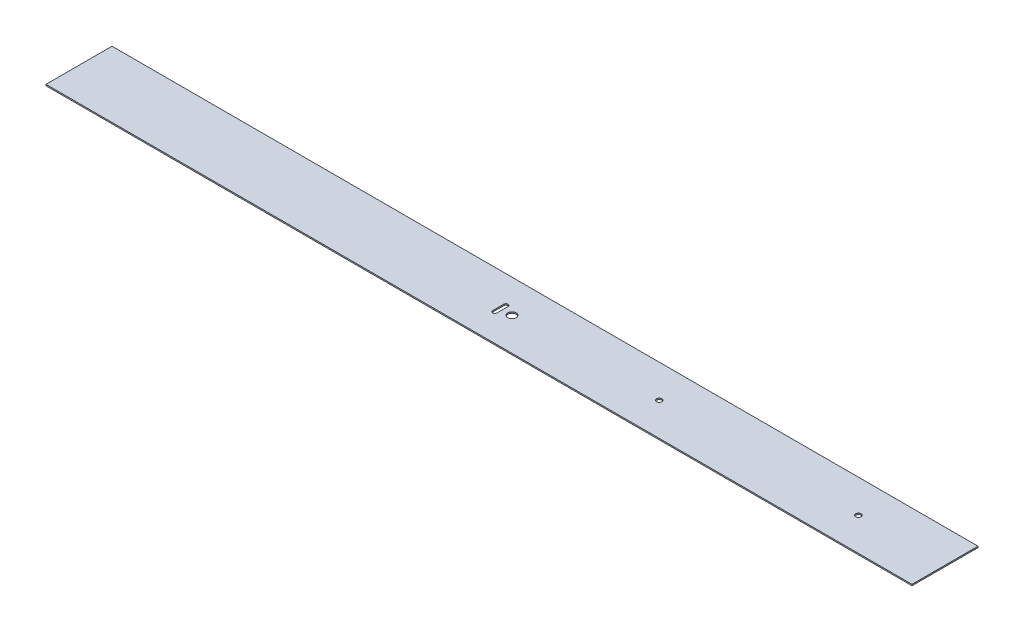
ISO-10303-21;
HEADER;
FILE_DESCRIPTION(('STEP AP214'),'2;1');
FILE_NAME('part.step','',(''),(''),'','','');
FILE_SCHEMA(('AUTOMOTIVE_DESIGN { 1 0 10303 214 1 1 1 1 }'));
ENDSEC;
DATA;
#1=APPLICATION_CONTEXT('core data for automotive mechanical design processes');
#2=APPLICATION_PROTOCOL_DEFINITION('international standard','automotive_design',2000,#1);
#3=PRODUCT_CONTEXT('',#1,'mechanical');
#4=PRODUCT('Part','Part','',(#3));
#5=PRODUCT_RELATED_PRODUCT_CATEGORY('part','',(#4));
#6=PRODUCT_DEFINITION_FORMATION('','',#4);
#7=PRODUCT_DEFINITION_CONTEXT('part definition',#1,'design');
#8=PRODUCT_DEFINITION('design','',#6,#7);
#9=PRODUCT_DEFINITION_SHAPE('','',#8);
#10=(LENGTH_UNIT() NAMED_UNIT(*) SI_UNIT(.MILLI.,.METRE.));
#11=(NAMED_UNIT(*) PLANE_ANGLE_UNIT() SI_UNIT($,.RADIAN.));
#12=(NAMED_UNIT(*) SI_UNIT($,.STERADIAN.) SOLID_ANGLE_UNIT());
#13=UNCERTAINTY_MEASURE_WITH_UNIT(LENGTH_MEASURE(1.E-05),#10,'distance_accuracy_value','');
#14=(GEOMETRIC_REPRESENTATION_CONTEXT(3) GLOBAL_UNCERTAINTY_ASSIGNED_CONTEXT((#13)) GLOBAL_UNIT_ASSIGNED_CONTEXT((#10,
#11,#12)) REPRESENTATION_CONTEXT('',''));
#15=CARTESIAN_POINT('',(0.,0.,0.));
#16=DIRECTION('',(0.,0.,1.));
#17=DIRECTION('',(1.,0.,0.));
#18=AXIS2_PLACEMENT_3D('',#15,#16,#17);
#19=CARTESIAN_POINT('',(0.,0.75,0.));
#20=DIRECTION('',(0.,1.,0.));
#21=DIRECTION('',(0.,0.,1.));
#22=AXIS2_PLACEMENT_3D('',#19,#20,#21);
#23=PLANE('',#22);
#24=CARTESIAN_POINT('',(170.,0.75,0.));
#25=DIRECTION('',(0.,1.,0.));
#26=DIRECTION('',(0.,0.,1.));
#27=AXIS2_PLACEMENT_3D('',#24,#25,#26);
#28=CIRCLE('',#27,2.98);
#29=CARTESIAN_POINT('',(170.,0.75,2.98));
#30=VERTEX_POINT('',#29);
#31=EDGE_CURVE('E248',#30,#30,#28,.T.);
#32=ORIENTED_EDGE('',*,*,#31,.F.);
#33=EDGE_LOOP('',(#32));
#34=FACE_BOUND('',#33,.T.);
#35=CARTESIAN_POINT('',(400.,0.75,0.));
#36=DIRECTION('',(0.,1.,0.));
#37=DIRECTION('',(0.,0.,1.));
#38=AXIS2_PLACEMENT_3D('',#35,#36,#37);
#39=CIRCLE('',#38,3.11000000000003);
#40=CARTESIAN_POINT('',(400.,0.75,3.11000000000003));
#41=VERTEX_POINT('',#40);
#42=EDGE_CURVE('E253',#41,#41,#39,.T.);
#43=ORIENTED_EDGE('',*,*,#42,.F.);
#44=EDGE_LOOP('',(#43));
#45=FACE_BOUND('',#44,.T.);
#46=DIRECTION('',(0.,0.,-1.));
#47=VECTOR('',#46,1.);
#48=CARTESIAN_POINT('',(500.,0.75,-38.1000000000001));
#49=LINE('',#48,#47);
#50=CARTESIAN_POINT('',(500.,0.75,38.0999999999999));
#51=VERTEX_POINT('',#50);
#52=CARTESIAN_POINT('',(500.,0.75,-38.1000000000001));
#53=VERTEX_POINT('',#52);
#54=EDGE_CURVE('E145',#51,#53,#49,.T.);
#55=ORIENTED_EDGE('',*,*,#54,.T.);
#56=DIRECTION('',(-1.,0.,0.));
#57=VECTOR('',#56,1.);
#58=CARTESIAN_POINT('',(-500.,0.75,-38.1000000000001));
#59=LINE('',#58,#57);
#60=CARTESIAN_POINT('',(-500.,0.75,-38.1000000000001));
#61=VERTEX_POINT('',#60);
#62=EDGE_CURVE('E148',#53,#61,#59,.T.);
#63=ORIENTED_EDGE('',*,*,#62,.T.);
#64=DIRECTION('',(0.,0.,1.));
#65=VECTOR('',#64,1.);
#66=CARTESIAN_POINT('',(-500.,0.75,-38.1000000000001));
#67=LINE('',#66,#65);
#68=CARTESIAN_POINT('',(-500.,0.75,38.0999999999999));
#69=VERTEX_POINT('',#68);
#70=EDGE_CURVE('E151',#61,#69,#67,.T.);
#71=ORIENTED_EDGE('',*,*,#70,.T.);
#72=DIRECTION('',(1.,0.,0.));
#73=VECTOR('',#72,1.);
#74=CARTESIAN_POINT('',(-500.,0.75,38.0999999999999));
#75=LINE('',#74,#73);
#76=EDGE_CURVE('E153',#69,#51,#75,.T.);
#77=ORIENTED_EDGE('',*,*,#76,.T.);
#78=EDGE_LOOP('',(#55,#63,#71,#77));
#79=FACE_BOUND('',#78,.T.);
#80=CARTESIAN_POINT('',(0.,0.75,0.));
#81=DIRECTION('',(0.,1.,0.));
#82=DIRECTION('',(0.,0.,1.));
#83=AXIS2_PLACEMENT_3D('',#80,#81,#82);
#84=CIRCLE('',#83,4.83);
#85=CARTESIAN_POINT('',(0.,0.75,4.83));
#86=VERTEX_POINT('',#85);
#87=EDGE_CURVE('E139',#86,#86,#84,.T.);
#88=ORIENTED_EDGE('',*,*,#87,.F.);
#89=EDGE_LOOP('',(#88));
#90=FACE_BOUND('',#89,.T.);
#91=DIRECTION('',(0.,0.,-1.));
#92=VECTOR('',#91,1.);
#93=CARTESIAN_POINT('',(-11.,0.75,6.35));
#94=LINE('',#93,#92);
#95=CARTESIAN_POINT('',(-11.,0.75,6.35));
#96=VERTEX_POINT('',#95);
#97=CARTESIAN_POINT('',(-11.,0.75,-6.35));
#98=VERTEX_POINT('',#97);
#99=EDGE_CURVE('E109',#96,#98,#94,.T.);
#100=ORIENTED_EDGE('',*,*,#99,.F.);
#101=CARTESIAN_POINT('',(-13.4,0.75,6.35));
#102=DIRECTION('',(0.,1.,0.));
#103=DIRECTION('',(0.,0.,1.));
#104=AXIS2_PLACEMENT_3D('',#101,#102,#103);
#105=CIRCLE('',#104,2.4);
#106=CARTESIAN_POINT('',(-15.8,0.75,6.35));
#107=VERTEX_POINT('',#106);
#108=EDGE_CURVE('E101',#107,#96,#105,.T.);
#109=ORIENTED_EDGE('',*,*,#108,.F.);
#110=DIRECTION('',(0.,0.,1.));
#111=VECTOR('',#110,1.);
#112=CARTESIAN_POINT('',(-15.8,0.75,6.35));
#113=LINE('',#112,#111);
#114=CARTESIAN_POINT('',(-15.8,0.75,-6.35));
#115=VERTEX_POINT('',#114);
#116=EDGE_CURVE('E123',#115,#107,#113,.T.);
#117=ORIENTED_EDGE('',*,*,#116,.F.);
#118=CARTESIAN_POINT('',(-13.4,0.75,-6.35));
#119=DIRECTION('',(0.,1.,0.));
#120=DIRECTION('',(0.,0.,1.));
#121=AXIS2_PLACEMENT_3D('',#118,#119,#120);
#122=CIRCLE('',#121,2.4);
#123=EDGE_CURVE('E121',#98,#115,#122,.T.);
#124=ORIENTED_EDGE('',*,*,#123,.F.);
#125=EDGE_LOOP('',(#100,#109,#117,#124));
#126=FACE_BOUND('',#125,.T.);
#127=ADVANCED_FACE('F36',(#34,#45,#79,#90,#126),#23,.T.);
#128=CARTESIAN_POINT('',(0.,-0.75,0.));
#129=DIRECTION('',(0.,1.,0.));
#130=DIRECTION('',(0.,0.,1.));
#131=AXIS2_PLACEMENT_3D('',#128,#129,#130);
#132=PLANE('',#131);
#133=CARTESIAN_POINT('',(170.,-0.75,0.));
#134=DIRECTION('',(0.,1.,0.));
#135=DIRECTION('',(0.,0.,1.));
#136=AXIS2_PLACEMENT_3D('',#133,#134,#135);
#137=CIRCLE('',#136,2.98);
#138=CARTESIAN_POINT('',(170.,-0.75,2.98));
#139=VERTEX_POINT('',#138);
#140=EDGE_CURVE('E129',#139,#139,#137,.T.);
#141=ORIENTED_EDGE('',*,*,#140,.T.);
#142=EDGE_LOOP('',(#141));
#143=FACE_BOUND('',#142,.T.);
#144=CARTESIAN_POINT('',(400.,-0.75,0.));
#145=DIRECTION('',(0.,1.,0.));
#146=DIRECTION('',(0.,0.,1.));
#147=AXIS2_PLACEMENT_3D('',#144,#145,#146);
#148=CIRCLE('',#147,3.11000000000003);
#149=CARTESIAN_POINT('',(400.,-0.75,3.11000000000003));
#150=VERTEX_POINT('',#149);
#151=EDGE_CURVE('E249',#150,#150,#148,.T.);
#152=ORIENTED_EDGE('',*,*,#151,.T.);
#153=EDGE_LOOP('',(#152));
#154=FACE_BOUND('',#153,.T.);
#155=CARTESIAN_POINT('',(0.,-0.75,0.));
#156=DIRECTION('',(0.,1.,0.));
#157=DIRECTION('',(0.,0.,1.));
#158=AXIS2_PLACEMENT_3D('',#155,#156,#157);
#159=CIRCLE('',#158,4.83);
#160=CARTESIAN_POINT('',(0.,-0.75,4.83));
#161=VERTEX_POINT('',#160);
#162=EDGE_CURVE('E117',#161,#161,#159,.T.);
#163=ORIENTED_EDGE('',*,*,#162,.T.);
#164=EDGE_LOOP('',(#163));
#165=FACE_BOUND('',#164,.T.);
#166=DIRECTION('',(0.,0.,-1.));
#167=VECTOR('',#166,1.);
#168=CARTESIAN_POINT('',(500.,-0.75,-38.1000000000001));
#169=LINE('',#168,#167);
#170=CARTESIAN_POINT('',(500.,-0.75,38.0999999999999));
#171=VERTEX_POINT('',#170);
#172=CARTESIAN_POINT('',(500.,-0.75,-38.1000000000001));
#173=VERTEX_POINT('',#172);
#174=EDGE_CURVE('E142',#171,#173,#169,.T.);
#175=ORIENTED_EDGE('',*,*,#174,.F.);
#176=DIRECTION('',(1.,0.,0.));
#177=VECTOR('',#176,1.);
#178=CARTESIAN_POINT('',(-500.,-0.75,38.0999999999999));
#179=LINE('',#178,#177);
#180=CARTESIAN_POINT('',(-500.,-0.75,38.0999999999999));
#181=VERTEX_POINT('',#180);
#182=EDGE_CURVE('E149',#181,#171,#179,.T.);
#183=ORIENTED_EDGE('',*,*,#182,.F.);
#184=DIRECTION('',(0.,0.,1.));
#185=VECTOR('',#184,1.);
#186=CARTESIAN_POINT('',(-500.,-0.75,-38.1000000000001));
#187=LINE('',#186,#185);
#188=CARTESIAN_POINT('',(-500.,-0.75,-38.1000000000001));
#189=VERTEX_POINT('',#188);
#190=EDGE_CURVE('E160',#189,#181,#187,.T.);
#191=ORIENTED_EDGE('',*,*,#190,.F.);
#192=DIRECTION('',(-1.,0.,0.));
#193=VECTOR('',#192,1.);
#194=CARTESIAN_POINT('',(-500.,-0.75,-38.1000000000001));
#195=LINE('',#194,#193);
#196=EDGE_CURVE('E158',#173,#189,#195,.T.);
#197=ORIENTED_EDGE('',*,*,#196,.F.);
#198=EDGE_LOOP('',(#175,#183,#191,#197));
#199=FACE_BOUND('',#198,.T.);
#200=CARTESIAN_POINT('',(-13.4,-0.75,6.35));
#201=DIRECTION('',(0.,1.,0.));
#202=DIRECTION('',(0.,0.,1.));
#203=AXIS2_PLACEMENT_3D('',#200,#201,#202);
#204=CIRCLE('',#203,2.4);
#205=CARTESIAN_POINT('',(-15.8,-0.75,6.35));
#206=VERTEX_POINT('',#205);
#207=CARTESIAN_POINT('',(-11.,-0.75,6.35));
#208=VERTEX_POINT('',#207);
#209=EDGE_CURVE('E59',#206,#208,#204,.T.);
#210=ORIENTED_EDGE('',*,*,#209,.T.);
#211=DIRECTION('',(0.,0.,-1.));
#212=VECTOR('',#211,1.);
#213=CARTESIAN_POINT('',(-11.,-0.75,6.35));
#214=LINE('',#213,#212);
#215=CARTESIAN_POINT('',(-11.,-0.75,-6.35));
#216=VERTEX_POINT('',#215);
#217=EDGE_CURVE('E116',#208,#216,#214,.T.);
#218=ORIENTED_EDGE('',*,*,#217,.T.);
#219=CARTESIAN_POINT('',(-13.4,-0.75,-6.35));
#220=DIRECTION('',(0.,1.,0.));
#221=DIRECTION('',(0.,0.,1.));
#222=AXIS2_PLACEMENT_3D('',#219,#220,#221);
#223=CIRCLE('',#222,2.4);
#224=CARTESIAN_POINT('',(-15.8,-0.75,-6.35));
#225=VERTEX_POINT('',#224);
#226=EDGE_CURVE('E131',#216,#225,#223,.T.);
#227=ORIENTED_EDGE('',*,*,#226,.T.);
#228=DIRECTION('',(0.,0.,1.));
#229=VECTOR('',#228,1.);
#230=CARTESIAN_POINT('',(-15.8,-0.75,6.35));
#231=LINE('',#230,#229);
#232=EDGE_CURVE('E110',#225,#206,#231,.T.);
#233=ORIENTED_EDGE('',*,*,#232,.T.);
#234=EDGE_LOOP('',(#210,#218,#227,#233));
#235=FACE_BOUND('',#234,.T.);
#236=ADVANCED_FACE('F178',(#143,#154,#165,#199,#235),#132,.F.);
#237=CARTESIAN_POINT('',(500.,0.75,-38.1000000000001));
#238=DIRECTION('',(-1.,0.,0.));
#239=DIRECTION('',(0.,0.,1.));
#240=AXIS2_PLACEMENT_3D('',#237,#238,#239);
#241=PLANE('',#240);
#242=ORIENTED_EDGE('',*,*,#174,.T.);
#243=DIRECTION('',(0.,-1.,0.));
#244=VECTOR('',#243,1.);
#245=CARTESIAN_POINT('',(500.,0.75,-38.1000000000001));
#246=LINE('',#245,#244);
#247=EDGE_CURVE('E11',#53,#173,#246,.T.);
#248=ORIENTED_EDGE('',*,*,#247,.F.);
#249=ORIENTED_EDGE('',*,*,#54,.F.);
#250=DIRECTION('',(0.,-1.,0.));
#251=VECTOR('',#250,1.);
#252=CARTESIAN_POINT('',(500.,0.75,38.0999999999999));
#253=LINE('',#252,#251);
#254=EDGE_CURVE('E155',#51,#171,#253,.T.);
#255=ORIENTED_EDGE('',*,*,#254,.T.);
#256=EDGE_LOOP('',(#242,#248,#249,#255));
#257=FACE_BOUND('',#256,.T.);
#258=ADVANCED_FACE('F38',(#257),#241,.F.);
#259=CARTESIAN_POINT('',(-500.,0.75,-38.1000000000001));
#260=DIRECTION('',(0.,0.,1.));
#261=DIRECTION('',(1.,0.,0.));
#262=AXIS2_PLACEMENT_3D('',#259,#260,#261);
#263=PLANE('',#262);
#264=ORIENTED_EDGE('',*,*,#196,.T.);
#265=DIRECTION('',(0.,-1.,0.));
#266=VECTOR('',#265,1.);
#267=CARTESIAN_POINT('',(-500.,0.75,-38.1000000000001));
#268=LINE('',#267,#266);
#269=EDGE_CURVE('E44',#61,#189,#268,.T.);
#270=ORIENTED_EDGE('',*,*,#269,.F.);
#271=ORIENTED_EDGE('',*,*,#62,.F.);
#272=ORIENTED_EDGE('',*,*,#247,.T.);
#273=EDGE_LOOP('',(#264,#270,#271,#272));
#274=FACE_BOUND('',#273,.T.);
#275=ADVANCED_FACE('F189',(#274),#263,.F.);
#276=CARTESIAN_POINT('',(-500.,0.75,-38.1000000000001));
#277=DIRECTION('',(1.,0.,0.));
#278=DIRECTION('',(0.,0.,-1.));
#279=AXIS2_PLACEMENT_3D('',#276,#277,#278);
#280=PLANE('',#279);
#281=ORIENTED_EDGE('',*,*,#190,.T.);
#282=DIRECTION('',(0.,-1.,0.));
#283=VECTOR('',#282,1.);
#284=CARTESIAN_POINT('',(-500.,0.75,38.0999999999999));
#285=LINE('',#284,#283);
#286=EDGE_CURVE('E165',#69,#181,#285,.T.);
#287=ORIENTED_EDGE('',*,*,#286,.F.);
#288=ORIENTED_EDGE('',*,*,#70,.F.);
#289=ORIENTED_EDGE('',*,*,#269,.T.);
#290=EDGE_LOOP('',(#281,#287,#288,#289));
#291=FACE_BOUND('',#290,.T.);
#292=ADVANCED_FACE('F172',(#291),#280,.F.);
#293=CARTESIAN_POINT('',(-500.,0.75,38.0999999999999));
#294=DIRECTION('',(0.,0.,-1.));
#295=DIRECTION('',(-1.,0.,0.));
#296=AXIS2_PLACEMENT_3D('',#293,#294,#295);
#297=PLANE('',#296);
#298=ORIENTED_EDGE('',*,*,#182,.T.);
#299=ORIENTED_EDGE('',*,*,#254,.F.);
#300=ORIENTED_EDGE('',*,*,#76,.F.);
#301=ORIENTED_EDGE('',*,*,#286,.T.);
#302=EDGE_LOOP('',(#298,#299,#300,#301));
#303=FACE_BOUND('',#302,.T.);
#304=ADVANCED_FACE('F182',(#303),#297,.F.);
#305=CARTESIAN_POINT('',(0.,0.75,0.));
#306=DIRECTION('',(0.,-1.,0.));
#307=DIRECTION('',(0.,0.,-1.));
#308=AXIS2_PLACEMENT_3D('',#305,#306,#307);
#309=CYLINDRICAL_SURFACE('',#308,4.83);
#310=ORIENTED_EDGE('',*,*,#87,.T.);
#311=EDGE_LOOP('',(#310));
#312=FACE_BOUND('',#311,.T.);
#313=ORIENTED_EDGE('',*,*,#162,.F.);
#314=EDGE_LOOP('',(#313));
#315=FACE_BOUND('',#314,.T.);
#316=ADVANCED_FACE('F208',(#312,#315),#309,.F.);
#317=CARTESIAN_POINT('',(-13.4,0.75,6.35));
#318=DIRECTION('',(0.,-1.,0.));
#319=DIRECTION('',(0.,0.,-1.));
#320=AXIS2_PLACEMENT_3D('',#317,#318,#319);
#321=CYLINDRICAL_SURFACE('',#320,2.4);
#322=ORIENTED_EDGE('',*,*,#209,.F.);
#323=DIRECTION('',(0.,-1.,0.));
#324=VECTOR('',#323,1.);
#325=CARTESIAN_POINT('',(-15.8,0.75,6.35));
#326=LINE('',#325,#324);
#327=EDGE_CURVE('E105',#107,#206,#326,.T.);
#328=ORIENTED_EDGE('',*,*,#327,.F.);
#329=ORIENTED_EDGE('',*,*,#108,.T.);
#330=DIRECTION('',(0.,-1.,0.));
#331=VECTOR('',#330,1.);
#332=CARTESIAN_POINT('',(-11.,0.75,6.35));
#333=LINE('',#332,#331);
#334=EDGE_CURVE('E104',#96,#208,#333,.T.);
#335=ORIENTED_EDGE('',*,*,#334,.T.);
#336=EDGE_LOOP('',(#322,#328,#329,#335));
#337=FACE_BOUND('',#336,.T.);
#338=ADVANCED_FACE('F103',(#337),#321,.F.);
#339=CARTESIAN_POINT('',(-11.,0.75,6.35));
#340=DIRECTION('',(-1.,0.,0.));
#341=DIRECTION('',(0.,0.,1.));
#342=AXIS2_PLACEMENT_3D('',#339,#340,#341);
#343=PLANE('',#342);
#344=ORIENTED_EDGE('',*,*,#217,.F.);
#345=ORIENTED_EDGE('',*,*,#334,.F.);
#346=ORIENTED_EDGE('',*,*,#99,.T.);
#347=DIRECTION('',(0.,-1.,0.));
#348=VECTOR('',#347,1.);
#349=CARTESIAN_POINT('',(-11.,0.75,-6.35));
#350=LINE('',#349,#348);
#351=EDGE_CURVE('E118',#98,#216,#350,.T.);
#352=ORIENTED_EDGE('',*,*,#351,.T.);
#353=EDGE_LOOP('',(#344,#345,#346,#352));
#354=FACE_BOUND('',#353,.T.);
#355=ADVANCED_FACE('F113',(#354),#343,.T.);
#356=CARTESIAN_POINT('',(-13.4,0.75,-6.35));
#357=DIRECTION('',(0.,-1.,0.));
#358=DIRECTION('',(0.,0.,-1.));
#359=AXIS2_PLACEMENT_3D('',#356,#357,#358);
#360=CYLINDRICAL_SURFACE('',#359,2.4);
#361=ORIENTED_EDGE('',*,*,#226,.F.);
#362=ORIENTED_EDGE('',*,*,#351,.F.);
#363=ORIENTED_EDGE('',*,*,#123,.T.);
#364=DIRECTION('',(0.,-1.,0.));
#365=VECTOR('',#364,1.);
#366=CARTESIAN_POINT('',(-15.8,0.75,-6.35));
#367=LINE('',#366,#365);
#368=EDGE_CURVE('E51',#115,#225,#367,.T.);
#369=ORIENTED_EDGE('',*,*,#368,.T.);
#370=EDGE_LOOP('',(#361,#362,#363,#369));
#371=FACE_BOUND('',#370,.T.);
#372=ADVANCED_FACE('F226',(#371),#360,.F.);
#373=CARTESIAN_POINT('',(-15.8,0.75,6.35));
#374=DIRECTION('',(1.,0.,0.));
#375=DIRECTION('',(0.,0.,-1.));
#376=AXIS2_PLACEMENT_3D('',#373,#374,#375);
#377=PLANE('',#376);
#378=ORIENTED_EDGE('',*,*,#232,.F.);
#379=ORIENTED_EDGE('',*,*,#368,.F.);
#380=ORIENTED_EDGE('',*,*,#116,.T.);
#381=ORIENTED_EDGE('',*,*,#327,.T.);
#382=EDGE_LOOP('',(#378,#379,#380,#381));
#383=FACE_BOUND('',#382,.T.);
#384=ADVANCED_FACE('F231',(#383),#377,.T.);
#385=CARTESIAN_POINT('',(400.,-0.75,0.));
#386=DIRECTION('',(0.,1.,0.));
#387=DIRECTION('',(0.,0.,1.));
#388=AXIS2_PLACEMENT_3D('',#385,#386,#387);
#389=CYLINDRICAL_SURFACE('',#388,3.11000000000003);
#390=ORIENTED_EDGE('',*,*,#151,.F.);
#391=EDGE_LOOP('',(#390));
#392=FACE_BOUND('',#391,.T.);
#393=ORIENTED_EDGE('',*,*,#42,.T.);
#394=EDGE_LOOP('',(#393));
#395=FACE_BOUND('',#394,.T.);
#396=ADVANCED_FACE('F235',(#392,#395),#389,.F.);
#397=CARTESIAN_POINT('',(170.,-0.75,0.));
#398=DIRECTION('',(0.,1.,0.));
#399=DIRECTION('',(0.,0.,1.));
#400=AXIS2_PLACEMENT_3D('',#397,#398,#399);
#401=CYLINDRICAL_SURFACE('',#400,2.98);
#402=ORIENTED_EDGE('',*,*,#140,.F.);
#403=EDGE_LOOP('',(#402));
#404=FACE_BOUND('',#403,.T.);
#405=ORIENTED_EDGE('',*,*,#31,.T.);
#406=EDGE_LOOP('',(#405));
#407=FACE_BOUND('',#406,.T.);
#408=ADVANCED_FACE('F238',(#404,#407),#401,.F.);
#409=CLOSED_SHELL('',(#127,#236,#258,#275,#292,#304,#316,#338,#355,#372,#384,#396,#408));
#410=MANIFOLD_SOLID_BREP('B2',#409);
#411=ADVANCED_BREP_SHAPE_REPRESENTATION('',(#18,#410),#14);
#412=SHAPE_DEFINITION_REPRESENTATION(#9,#411);
ENDSEC;
END-ISO-10303-21;
